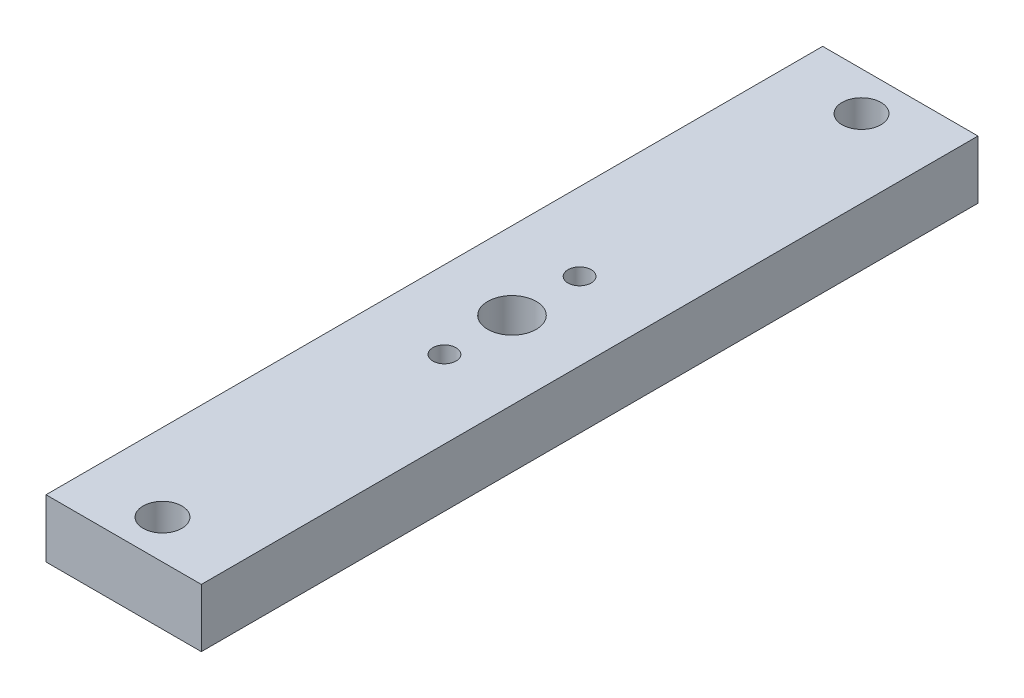
ISO-10303-21;
HEADER;
FILE_DESCRIPTION(('STEP AP214'),'2;1');
FILE_NAME('part.step','',(''),(''),'','','');
FILE_SCHEMA(('AUTOMOTIVE_DESIGN { 1 0 10303 214 1 1 1 1 }'));
ENDSEC;
DATA;
#1=APPLICATION_CONTEXT('core data for automotive mechanical design processes');
#2=APPLICATION_PROTOCOL_DEFINITION('international standard','automotive_design',2000,#1);
#3=PRODUCT_CONTEXT('',#1,'mechanical');
#4=PRODUCT('Part','Part','',(#3));
#5=PRODUCT_RELATED_PRODUCT_CATEGORY('part','',(#4));
#6=PRODUCT_DEFINITION_FORMATION('','',#4);
#7=PRODUCT_DEFINITION_CONTEXT('part definition',#1,'design');
#8=PRODUCT_DEFINITION('design','',#6,#7);
#9=PRODUCT_DEFINITION_SHAPE('','',#8);
#10=(LENGTH_UNIT() NAMED_UNIT(*) SI_UNIT(.MILLI.,.METRE.));
#11=(NAMED_UNIT(*) PLANE_ANGLE_UNIT() SI_UNIT($,.RADIAN.));
#12=(NAMED_UNIT(*) SI_UNIT($,.STERADIAN.) SOLID_ANGLE_UNIT());
#13=UNCERTAINTY_MEASURE_WITH_UNIT(LENGTH_MEASURE(1.E-05),#10,'distance_accuracy_value','');
#14=(GEOMETRIC_REPRESENTATION_CONTEXT(3) GLOBAL_UNCERTAINTY_ASSIGNED_CONTEXT((#13)) GLOBAL_UNIT_ASSIGNED_CONTEXT((#10,
#11,#12)) REPRESENTATION_CONTEXT('',''));
#15=CARTESIAN_POINT('',(0.,0.,0.));
#16=DIRECTION('',(0.,0.,1.));
#17=DIRECTION('',(1.,0.,0.));
#18=AXIS2_PLACEMENT_3D('',#15,#16,#17);
#19=CARTESIAN_POINT('',(-12.7,4.7625,127.));
#20=DIRECTION('',(0.,-1.,0.));
#21=DIRECTION('',(0.,0.,-1.));
#22=AXIS2_PLACEMENT_3D('',#19,#20,#21);
#23=PLANE('',#22);
#24=CARTESIAN_POINT('',(0.,4.7625,52.451));
#25=DIRECTION('',(0.,1.,0.));
#26=DIRECTION('',(0.,0.,1.));
#27=AXIS2_PLACEMENT_3D('',#24,#25,#26);
#28=CIRCLE('',#27,1.89865);
#29=CARTESIAN_POINT('',(0.,4.7625,54.34965));
#30=VERTEX_POINT('',#29);
#31=EDGE_CURVE('E132',#30,#30,#28,.T.);
#32=ORIENTED_EDGE('',*,*,#31,.F.);
#33=EDGE_LOOP('',(#32));
#34=FACE_BOUND('',#33,.T.);
#35=CARTESIAN_POINT('',(0.,4.7625,74.549));
#36=DIRECTION('',(0.,1.,0.));
#37=DIRECTION('',(0.,0.,1.));
#38=AXIS2_PLACEMENT_3D('',#35,#36,#37);
#39=CIRCLE('',#38,1.89865);
#40=CARTESIAN_POINT('',(0.,4.7625,76.44765));
#41=VERTEX_POINT('',#40);
#42=EDGE_CURVE('E122',#41,#41,#39,.T.);
#43=ORIENTED_EDGE('',*,*,#42,.F.);
#44=EDGE_LOOP('',(#43));
#45=FACE_BOUND('',#44,.T.);
#46=CARTESIAN_POINT('',(0.,4.7625,63.5));
#47=DIRECTION('',(0.,1.,0.));
#48=DIRECTION('',(0.,0.,1.));
#49=AXIS2_PLACEMENT_3D('',#46,#47,#48);
#50=CIRCLE('',#49,3.96875);
#51=CARTESIAN_POINT('',(0.,4.7625,67.46875));
#52=VERTEX_POINT('',#51);
#53=EDGE_CURVE('E119',#52,#52,#50,.T.);
#54=ORIENTED_EDGE('',*,*,#53,.F.);
#55=EDGE_LOOP('',(#54));
#56=FACE_BOUND('',#55,.T.);
#57=CARTESIAN_POINT('',(0.,4.7625,6.34999999999999));
#58=DIRECTION('',(0.,1.,0.));
#59=DIRECTION('',(0.,0.,1.));
#60=AXIS2_PLACEMENT_3D('',#57,#58,#59);
#61=CIRCLE('',#60,3.17499999999999);
#62=CARTESIAN_POINT('',(0.,4.7625,9.52499999999998));
#63=VERTEX_POINT('',#62);
#64=EDGE_CURVE('E116',#63,#63,#61,.T.);
#65=ORIENTED_EDGE('',*,*,#64,.F.);
#66=EDGE_LOOP('',(#65));
#67=FACE_BOUND('',#66,.T.);
#68=CARTESIAN_POINT('',(0.,4.7625,120.65));
#69=DIRECTION('',(0.,1.,0.));
#70=DIRECTION('',(0.,0.,1.));
#71=AXIS2_PLACEMENT_3D('',#68,#69,#70);
#72=CIRCLE('',#71,3.17499999999999);
#73=CARTESIAN_POINT('',(0.,4.7625,123.825));
#74=VERTEX_POINT('',#73);
#75=EDGE_CURVE('E115',#74,#74,#72,.T.);
#76=ORIENTED_EDGE('',*,*,#75,.F.);
#77=EDGE_LOOP('',(#76));
#78=FACE_BOUND('',#77,.T.);
#79=DIRECTION('',(-1.,0.,0.));
#80=VECTOR('',#79,1.);
#81=CARTESIAN_POINT('',(-12.7,4.7625,0.));
#82=LINE('',#81,#80);
#83=CARTESIAN_POINT('',(12.7,4.7625,0.));
#84=VERTEX_POINT('',#83);
#85=CARTESIAN_POINT('',(-12.7,4.7625,0.));
#86=VERTEX_POINT('',#85);
#87=EDGE_CURVE('E103',#84,#86,#82,.T.);
#88=ORIENTED_EDGE('',*,*,#87,.T.);
#89=DIRECTION('',(0.,0.,-1.));
#90=VECTOR('',#89,1.);
#91=CARTESIAN_POINT('',(-12.7,4.7625,127.));
#92=LINE('',#91,#90);
#93=CARTESIAN_POINT('',(-12.7,4.7625,127.));
#94=VERTEX_POINT('',#93);
#95=EDGE_CURVE('E11',#94,#86,#92,.T.);
#96=ORIENTED_EDGE('',*,*,#95,.F.);
#97=DIRECTION('',(-1.,0.,0.));
#98=VECTOR('',#97,1.);
#99=CARTESIAN_POINT('',(-12.7,4.7625,127.));
#100=LINE('',#99,#98);
#101=CARTESIAN_POINT('',(12.7,4.7625,127.));
#102=VERTEX_POINT('',#101);
#103=EDGE_CURVE('E90',#102,#94,#100,.T.);
#104=ORIENTED_EDGE('',*,*,#103,.F.);
#105=DIRECTION('',(0.,0.,-1.));
#106=VECTOR('',#105,1.);
#107=CARTESIAN_POINT('',(12.7,4.7625,127.));
#108=LINE('',#107,#106);
#109=EDGE_CURVE('E99',#102,#84,#108,.T.);
#110=ORIENTED_EDGE('',*,*,#109,.T.);
#111=EDGE_LOOP('',(#88,#96,#104,#110));
#112=FACE_BOUND('',#111,.T.);
#113=ADVANCED_FACE('F37',(#34,#45,#56,#67,#78,#112),#23,.F.);
#114=CARTESIAN_POINT('',(-12.7,-4.7625,127.));
#115=DIRECTION('',(1.,0.,0.));
#116=DIRECTION('',(0.,0.,-1.));
#117=AXIS2_PLACEMENT_3D('',#114,#115,#116);
#118=PLANE('',#117);
#119=DIRECTION('',(0.,-1.,0.));
#120=VECTOR('',#119,1.);
#121=CARTESIAN_POINT('',(-12.7,-4.7625,0.));
#122=LINE('',#121,#120);
#123=CARTESIAN_POINT('',(-12.7,-4.7625,0.));
#124=VERTEX_POINT('',#123);
#125=EDGE_CURVE('E94',#86,#124,#122,.T.);
#126=ORIENTED_EDGE('',*,*,#125,.T.);
#127=DIRECTION('',(0.,0.,-1.));
#128=VECTOR('',#127,1.);
#129=CARTESIAN_POINT('',(-12.7,-4.7625,127.));
#130=LINE('',#129,#128);
#131=CARTESIAN_POINT('',(-12.7,-4.7625,127.));
#132=VERTEX_POINT('',#131);
#133=EDGE_CURVE('E46',#132,#124,#130,.T.);
#134=ORIENTED_EDGE('',*,*,#133,.F.);
#135=DIRECTION('',(0.,-1.,0.));
#136=VECTOR('',#135,1.);
#137=CARTESIAN_POINT('',(-12.7,-4.7625,127.));
#138=LINE('',#137,#136);
#139=EDGE_CURVE('E85',#94,#132,#138,.T.);
#140=ORIENTED_EDGE('',*,*,#139,.F.);
#141=ORIENTED_EDGE('',*,*,#95,.T.);
#142=EDGE_LOOP('',(#126,#134,#140,#141));
#143=FACE_BOUND('',#142,.T.);
#144=ADVANCED_FACE('F93',(#143),#118,.F.);
#145=CARTESIAN_POINT('',(-12.7,-4.7625,127.));
#146=DIRECTION('',(0.,1.,0.));
#147=DIRECTION('',(0.,0.,1.));
#148=AXIS2_PLACEMENT_3D('',#145,#146,#147);
#149=PLANE('',#148);
#150=CARTESIAN_POINT('',(0.,-4.7625,52.451));
#151=DIRECTION('',(0.,1.,0.));
#152=DIRECTION('',(0.,0.,1.));
#153=AXIS2_PLACEMENT_3D('',#150,#151,#152);
#154=CIRCLE('',#153,1.89865);
#155=CARTESIAN_POINT('',(0.,-4.7625,54.34965));
#156=VERTEX_POINT('',#155);
#157=EDGE_CURVE('E40',#156,#156,#154,.T.);
#158=ORIENTED_EDGE('',*,*,#157,.T.);
#159=EDGE_LOOP('',(#158));
#160=FACE_BOUND('',#159,.T.);
#161=CARTESIAN_POINT('',(0.,-4.7625,74.549));
#162=DIRECTION('',(0.,1.,0.));
#163=DIRECTION('',(0.,0.,1.));
#164=AXIS2_PLACEMENT_3D('',#161,#162,#163);
#165=CIRCLE('',#164,1.89865);
#166=CARTESIAN_POINT('',(0.,-4.7625,76.44765));
#167=VERTEX_POINT('',#166);
#168=EDGE_CURVE('E120',#167,#167,#165,.T.);
#169=ORIENTED_EDGE('',*,*,#168,.T.);
#170=EDGE_LOOP('',(#169));
#171=FACE_BOUND('',#170,.T.);
#172=CARTESIAN_POINT('',(0.,-4.7625,63.5));
#173=DIRECTION('',(0.,1.,0.));
#174=DIRECTION('',(0.,0.,1.));
#175=AXIS2_PLACEMENT_3D('',#172,#173,#174);
#176=CIRCLE('',#175,3.96875);
#177=CARTESIAN_POINT('',(0.,-4.7625,67.46875));
#178=VERTEX_POINT('',#177);
#179=EDGE_CURVE('E117',#178,#178,#176,.T.);
#180=ORIENTED_EDGE('',*,*,#179,.T.);
#181=EDGE_LOOP('',(#180));
#182=FACE_BOUND('',#181,.T.);
#183=CARTESIAN_POINT('',(0.,-4.7625,6.34999999999999));
#184=DIRECTION('',(0.,1.,0.));
#185=DIRECTION('',(0.,0.,1.));
#186=AXIS2_PLACEMENT_3D('',#183,#184,#185);
#187=CIRCLE('',#186,3.17499999999999);
#188=CARTESIAN_POINT('',(0.,-4.7625,9.52499999999998));
#189=VERTEX_POINT('',#188);
#190=EDGE_CURVE('E112',#189,#189,#187,.T.);
#191=ORIENTED_EDGE('',*,*,#190,.T.);
#192=EDGE_LOOP('',(#191));
#193=FACE_BOUND('',#192,.T.);
#194=CARTESIAN_POINT('',(0.,-4.7625,120.65));
#195=DIRECTION('',(0.,1.,0.));
#196=DIRECTION('',(0.,0.,1.));
#197=AXIS2_PLACEMENT_3D('',#194,#195,#196);
#198=CIRCLE('',#197,3.17499999999999);
#199=CARTESIAN_POINT('',(0.,-4.7625,123.825));
#200=VERTEX_POINT('',#199);
#201=EDGE_CURVE('E106',#200,#200,#198,.T.);
#202=ORIENTED_EDGE('',*,*,#201,.T.);
#203=EDGE_LOOP('',(#202));
#204=FACE_BOUND('',#203,.T.);
#205=DIRECTION('',(1.,0.,0.));
#206=VECTOR('',#205,1.);
#207=CARTESIAN_POINT('',(-12.7,-4.7625,0.));
#208=LINE('',#207,#206);
#209=CARTESIAN_POINT('',(12.7,-4.7625,0.));
#210=VERTEX_POINT('',#209);
#211=EDGE_CURVE('E72',#124,#210,#208,.T.);
#212=ORIENTED_EDGE('',*,*,#211,.T.);
#213=DIRECTION('',(0.,0.,-1.));
#214=VECTOR('',#213,1.);
#215=CARTESIAN_POINT('',(12.7,-4.7625,127.));
#216=LINE('',#215,#214);
#217=CARTESIAN_POINT('',(12.7,-4.7625,127.));
#218=VERTEX_POINT('',#217);
#219=EDGE_CURVE('E95',#218,#210,#216,.T.);
#220=ORIENTED_EDGE('',*,*,#219,.F.);
#221=DIRECTION('',(1.,0.,0.));
#222=VECTOR('',#221,1.);
#223=CARTESIAN_POINT('',(-12.7,-4.7625,127.));
#224=LINE('',#223,#222);
#225=EDGE_CURVE('E88',#132,#218,#224,.T.);
#226=ORIENTED_EDGE('',*,*,#225,.F.);
#227=ORIENTED_EDGE('',*,*,#133,.T.);
#228=EDGE_LOOP('',(#212,#220,#226,#227));
#229=FACE_BOUND('',#228,.T.);
#230=ADVANCED_FACE('F97',(#160,#171,#182,#193,#204,#229),#149,.F.);
#231=CARTESIAN_POINT('',(12.7,-4.7625,127.));
#232=DIRECTION('',(-1.,0.,0.));
#233=DIRECTION('',(0.,-1.,0.));
#234=AXIS2_PLACEMENT_3D('',#231,#232,#233);
#235=PLANE('',#234);
#236=DIRECTION('',(0.,1.,0.));
#237=VECTOR('',#236,1.);
#238=CARTESIAN_POINT('',(12.7,-4.7625,0.));
#239=LINE('',#238,#237);
#240=EDGE_CURVE('E78',#210,#84,#239,.T.);
#241=ORIENTED_EDGE('',*,*,#240,.T.);
#242=ORIENTED_EDGE('',*,*,#109,.F.);
#243=DIRECTION('',(0.,1.,0.));
#244=VECTOR('',#243,1.);
#245=CARTESIAN_POINT('',(12.7,-4.7625,127.));
#246=LINE('',#245,#244);
#247=EDGE_CURVE('E55',#218,#102,#246,.T.);
#248=ORIENTED_EDGE('',*,*,#247,.F.);
#249=ORIENTED_EDGE('',*,*,#219,.T.);
#250=EDGE_LOOP('',(#241,#242,#248,#249));
#251=FACE_BOUND('',#250,.T.);
#252=ADVANCED_FACE('F175',(#251),#235,.F.);
#253=CARTESIAN_POINT('',(12.7,4.7625,127.));
#254=DIRECTION('',(0.,0.,1.));
#255=DIRECTION('',(1.,0.,0.));
#256=AXIS2_PLACEMENT_3D('',#253,#254,#255);
#257=PLANE('',#256);
#258=ORIENTED_EDGE('',*,*,#103,.T.);
#259=ORIENTED_EDGE('',*,*,#139,.T.);
#260=ORIENTED_EDGE('',*,*,#225,.T.);
#261=ORIENTED_EDGE('',*,*,#247,.T.);
#262=EDGE_LOOP('',(#258,#259,#260,#261));
#263=FACE_BOUND('',#262,.T.);
#264=ADVANCED_FACE('F86',(#263),#257,.T.);
#265=CARTESIAN_POINT('',(12.7,4.7625,0.));
#266=DIRECTION('',(0.,0.,1.));
#267=DIRECTION('',(1.,0.,0.));
#268=AXIS2_PLACEMENT_3D('',#265,#266,#267);
#269=PLANE('',#268);
#270=ORIENTED_EDGE('',*,*,#87,.F.);
#271=ORIENTED_EDGE('',*,*,#240,.F.);
#272=ORIENTED_EDGE('',*,*,#211,.F.);
#273=ORIENTED_EDGE('',*,*,#125,.F.);
#274=EDGE_LOOP('',(#270,#271,#272,#273));
#275=FACE_BOUND('',#274,.T.);
#276=ADVANCED_FACE('F146',(#275),#269,.F.);
#277=CARTESIAN_POINT('',(0.,4.7625,120.65));
#278=DIRECTION('',(0.,1.,0.));
#279=DIRECTION('',(0.,0.,1.));
#280=AXIS2_PLACEMENT_3D('',#277,#278,#279);
#281=CYLINDRICAL_SURFACE('',#280,3.17499999999999);
#282=ORIENTED_EDGE('',*,*,#75,.T.);
#283=EDGE_LOOP('',(#282));
#284=FACE_BOUND('',#283,.T.);
#285=ORIENTED_EDGE('',*,*,#201,.F.);
#286=EDGE_LOOP('',(#285));
#287=FACE_BOUND('',#286,.T.);
#288=ADVANCED_FACE('F143',(#284,#287),#281,.F.);
#289=CARTESIAN_POINT('',(0.,4.7625,6.34999999999999));
#290=DIRECTION('',(0.,1.,0.));
#291=DIRECTION('',(0.,0.,1.));
#292=AXIS2_PLACEMENT_3D('',#289,#290,#291);
#293=CYLINDRICAL_SURFACE('',#292,3.17499999999999);
#294=ORIENTED_EDGE('',*,*,#64,.T.);
#295=EDGE_LOOP('',(#294));
#296=FACE_BOUND('',#295,.T.);
#297=ORIENTED_EDGE('',*,*,#190,.F.);
#298=EDGE_LOOP('',(#297));
#299=FACE_BOUND('',#298,.T.);
#300=ADVANCED_FACE('F145',(#296,#299),#293,.F.);
#301=CARTESIAN_POINT('',(0.,4.7625,63.5));
#302=DIRECTION('',(0.,1.,0.));
#303=DIRECTION('',(0.,0.,1.));
#304=AXIS2_PLACEMENT_3D('',#301,#302,#303);
#305=CYLINDRICAL_SURFACE('',#304,3.96875);
#306=ORIENTED_EDGE('',*,*,#53,.T.);
#307=EDGE_LOOP('',(#306));
#308=FACE_BOUND('',#307,.T.);
#309=ORIENTED_EDGE('',*,*,#179,.F.);
#310=EDGE_LOOP('',(#309));
#311=FACE_BOUND('',#310,.T.);
#312=ADVANCED_FACE('F153',(#308,#311),#305,.F.);
#313=CARTESIAN_POINT('',(0.,4.7625,74.549));
#314=DIRECTION('',(0.,1.,0.));
#315=DIRECTION('',(0.,0.,1.));
#316=AXIS2_PLACEMENT_3D('',#313,#314,#315);
#317=CYLINDRICAL_SURFACE('',#316,1.89865);
#318=ORIENTED_EDGE('',*,*,#42,.T.);
#319=EDGE_LOOP('',(#318));
#320=FACE_BOUND('',#319,.T.);
#321=ORIENTED_EDGE('',*,*,#168,.F.);
#322=EDGE_LOOP('',(#321));
#323=FACE_BOUND('',#322,.T.);
#324=ADVANCED_FACE('F194',(#320,#323),#317,.F.);
#325=CARTESIAN_POINT('',(0.,4.7625,52.451));
#326=DIRECTION('',(0.,1.,0.));
#327=DIRECTION('',(0.,0.,1.));
#328=AXIS2_PLACEMENT_3D('',#325,#326,#327);
#329=CYLINDRICAL_SURFACE('',#328,1.89865);
#330=ORIENTED_EDGE('',*,*,#31,.T.);
#331=EDGE_LOOP('',(#330));
#332=FACE_BOUND('',#331,.T.);
#333=ORIENTED_EDGE('',*,*,#157,.F.);
#334=EDGE_LOOP('',(#333));
#335=FACE_BOUND('',#334,.T.);
#336=ADVANCED_FACE('F200',(#332,#335),#329,.F.);
#337=CLOSED_SHELL('',(#113,#144,#230,#252,#264,#276,#288,#300,#312,#324,#336));
#338=MANIFOLD_SOLID_BREP('B2',#337);
#339=ADVANCED_BREP_SHAPE_REPRESENTATION('',(#18,#338),#14);
#340=SHAPE_DEFINITION_REPRESENTATION(#9,#339);
ENDSEC;
END-ISO-10303-21;
